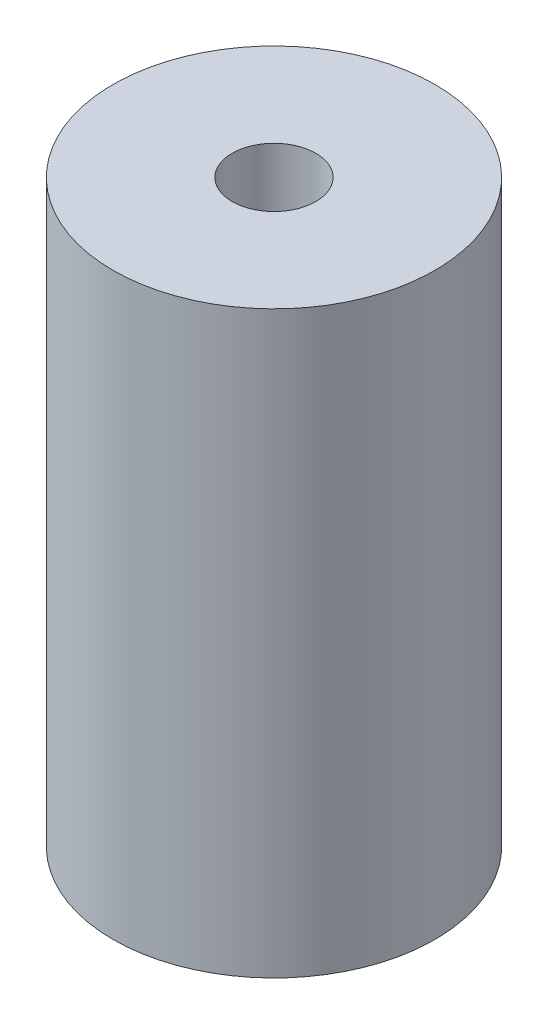
ISO-10303-21;
HEADER;
FILE_DESCRIPTION(('STEP AP214'),'2;1');
FILE_NAME('part.step','',(''),(''),'','','');
FILE_SCHEMA(('AUTOMOTIVE_DESIGN { 1 0 10303 214 1 1 1 1 }'));
ENDSEC;
DATA;
#1=APPLICATION_CONTEXT('core data for automotive mechanical design processes');
#2=APPLICATION_PROTOCOL_DEFINITION('international standard','automotive_design',2000,#1);
#3=PRODUCT_CONTEXT('',#1,'mechanical');
#4=PRODUCT('Part','Part','',(#3));
#5=PRODUCT_RELATED_PRODUCT_CATEGORY('part','',(#4));
#6=PRODUCT_DEFINITION_FORMATION('','',#4);
#7=PRODUCT_DEFINITION_CONTEXT('part definition',#1,'design');
#8=PRODUCT_DEFINITION('design','',#6,#7);
#9=PRODUCT_DEFINITION_SHAPE('','',#8);
#10=(LENGTH_UNIT() NAMED_UNIT(*) SI_UNIT(.MILLI.,.METRE.));
#11=(NAMED_UNIT(*) PLANE_ANGLE_UNIT() SI_UNIT($,.RADIAN.));
#12=(NAMED_UNIT(*) SI_UNIT($,.STERADIAN.) SOLID_ANGLE_UNIT());
#13=UNCERTAINTY_MEASURE_WITH_UNIT(LENGTH_MEASURE(1.E-05),#10,'distance_accuracy_value','');
#14=(GEOMETRIC_REPRESENTATION_CONTEXT(3) GLOBAL_UNCERTAINTY_ASSIGNED_CONTEXT((#13)) GLOBAL_UNIT_ASSIGNED_CONTEXT((#10,
#11,#12)) REPRESENTATION_CONTEXT('',''));
#15=CARTESIAN_POINT('',(0.,0.,0.));
#16=DIRECTION('',(0.,0.,1.));
#17=DIRECTION('',(1.,0.,0.));
#18=AXIS2_PLACEMENT_3D('',#15,#16,#17);
#19=CARTESIAN_POINT('',(0.,800.,0.));
#20=DIRECTION('',(0.,-1.,0.));
#21=DIRECTION('',(0.,0.,-1.));
#22=AXIS2_PLACEMENT_3D('',#19,#20,#21);
#23=CYLINDRICAL_SURFACE('',#22,200.);
#24=CARTESIAN_POINT('',(0.,800.,0.));
#25=DIRECTION('',(0.,-1.,0.));
#26=DIRECTION('',(0.,0.,-1.));
#27=AXIS2_PLACEMENT_3D('',#24,#25,#26);
#28=CIRCLE('',#27,200.);
#29=CARTESIAN_POINT('',(0.,800.,-200.));
#30=VERTEX_POINT('',#29);
#31=EDGE_CURVE('E59',#30,#30,#28,.T.);
#32=ORIENTED_EDGE('',*,*,#31,.F.);
#33=EDGE_LOOP('',(#32));
#34=FACE_BOUND('',#33,.T.);
#35=CARTESIAN_POINT('',(0.,100.,0.));
#36=DIRECTION('',(0.,-1.,0.));
#37=DIRECTION('',(0.,0.,-1.));
#38=AXIS2_PLACEMENT_3D('',#35,#36,#37);
#39=CIRCLE('',#38,200.);
#40=CARTESIAN_POINT('',(0.,100.,-200.));
#41=VERTEX_POINT('',#40);
#42=EDGE_CURVE('E61',#41,#41,#39,.T.);
#43=ORIENTED_EDGE('',*,*,#42,.T.);
#44=EDGE_LOOP('',(#43));
#45=FACE_BOUND('',#44,.T.);
#46=ADVANCED_FACE('F44',(#34,#45),#23,.F.);
#47=CARTESIAN_POINT('',(0.,800.,0.));
#48=DIRECTION('',(0.,-1.,0.));
#49=DIRECTION('',(0.,0.,-1.));
#50=AXIS2_PLACEMENT_3D('',#47,#48,#49);
#51=PLANE('',#50);
#52=CARTESIAN_POINT('',(0.,800.,0.));
#53=DIRECTION('',(0.,-1.,0.));
#54=DIRECTION('',(0.,0.,-1.));
#55=AXIS2_PLACEMENT_3D('',#52,#53,#54);
#56=CIRCLE('',#55,65.);
#57=CARTESIAN_POINT('',(0.,800.,-65.));
#58=VERTEX_POINT('',#57);
#59=EDGE_CURVE('E72',#58,#58,#56,.T.);
#60=ORIENTED_EDGE('',*,*,#59,.F.);
#61=EDGE_LOOP('',(#60));
#62=FACE_BOUND('',#61,.T.);
#63=ORIENTED_EDGE('',*,*,#31,.T.);
#64=EDGE_LOOP('',(#63));
#65=FACE_BOUND('',#64,.T.);
#66=ADVANCED_FACE('F111',(#62,#65),#51,.T.);
#67=CARTESIAN_POINT('',(0.,100.,0.));
#68=DIRECTION('',(0.,-1.,0.));
#69=DIRECTION('',(0.,0.,-1.));
#70=AXIS2_PLACEMENT_3D('',#67,#68,#69);
#71=PLANE('',#70);
#72=CARTESIAN_POINT('',(0.,100.,0.));
#73=DIRECTION('',(0.,-1.,0.));
#74=DIRECTION('',(0.,0.,-1.));
#75=AXIS2_PLACEMENT_3D('',#72,#73,#74);
#76=CIRCLE('',#75,65.);
#77=CARTESIAN_POINT('',(0.,100.,-65.));
#78=VERTEX_POINT('',#77);
#79=EDGE_CURVE('E48',#78,#78,#76,.T.);
#80=ORIENTED_EDGE('',*,*,#79,.T.);
#81=EDGE_LOOP('',(#80));
#82=FACE_BOUND('',#81,.T.);
#83=ORIENTED_EDGE('',*,*,#42,.F.);
#84=EDGE_LOOP('',(#83));
#85=FACE_BOUND('',#84,.T.);
#86=ADVANCED_FACE('F85',(#82,#85),#71,.F.);
#87=CARTESIAN_POINT('',(0.,-456.,0.));
#88=DIRECTION('',(0.,1.,0.));
#89=DIRECTION('',(0.,0.,1.));
#90=AXIS2_PLACEMENT_3D('',#87,#88,#89);
#91=CYLINDRICAL_SURFACE('',#90,65.);
#92=ORIENTED_EDGE('',*,*,#79,.F.);
#93=EDGE_LOOP('',(#92));
#94=FACE_BOUND('',#93,.T.);
#95=CARTESIAN_POINT('',(0.,0.,0.));
#96=DIRECTION('',(0.,1.,0.));
#97=DIRECTION('',(0.,0.,1.));
#98=AXIS2_PLACEMENT_3D('',#95,#96,#97);
#99=CIRCLE('',#98,65.);
#100=CARTESIAN_POINT('',(0.,0.,65.));
#101=VERTEX_POINT('',#100);
#102=EDGE_CURVE('E65',#101,#101,#99,.T.);
#103=ORIENTED_EDGE('',*,*,#102,.F.);
#104=EDGE_LOOP('',(#103));
#105=FACE_BOUND('',#104,.T.);
#106=ADVANCED_FACE('F88',(#94,#105),#91,.F.);
#107=ORIENTED_EDGE('',*,*,#59,.T.);
#108=EDGE_LOOP('',(#107));
#109=FACE_BOUND('',#108,.T.);
#110=CARTESIAN_POINT('',(0.,900.,0.));
#111=DIRECTION('',(0.,1.,0.));
#112=DIRECTION('',(0.,0.,1.));
#113=AXIS2_PLACEMENT_3D('',#110,#111,#112);
#114=CIRCLE('',#113,65.);
#115=CARTESIAN_POINT('',(0.,900.,65.));
#116=VERTEX_POINT('',#115);
#117=EDGE_CURVE('E76',#116,#116,#114,.T.);
#118=ORIENTED_EDGE('',*,*,#117,.T.);
#119=EDGE_LOOP('',(#118));
#120=FACE_BOUND('',#119,.T.);
#121=ADVANCED_FACE('F91',(#109,#120),#91,.F.);
#122=CARTESIAN_POINT('',(0.,900.,0.));
#123=DIRECTION('',(0.,-1.,0.));
#124=DIRECTION('',(0.,0.,-1.));
#125=AXIS2_PLACEMENT_3D('',#122,#123,#124);
#126=CYLINDRICAL_SURFACE('',#125,250.);
#127=CARTESIAN_POINT('',(0.,900.,0.));
#128=DIRECTION('',(0.,1.,0.));
#129=DIRECTION('',(0.,0.,1.));
#130=AXIS2_PLACEMENT_3D('',#127,#128,#129);
#131=CIRCLE('',#130,250.);
#132=CARTESIAN_POINT('',(0.,900.,250.));
#133=VERTEX_POINT('',#132);
#134=EDGE_CURVE('E10',#133,#133,#131,.T.);
#135=ORIENTED_EDGE('',*,*,#134,.F.);
#136=EDGE_LOOP('',(#135));
#137=FACE_BOUND('',#136,.T.);
#138=CARTESIAN_POINT('',(0.,0.,0.));
#139=DIRECTION('',(0.,1.,0.));
#140=DIRECTION('',(0.,0.,1.));
#141=AXIS2_PLACEMENT_3D('',#138,#139,#140);
#142=CIRCLE('',#141,250.);
#143=CARTESIAN_POINT('',(0.,0.,250.));
#144=VERTEX_POINT('',#143);
#145=EDGE_CURVE('E53',#144,#144,#142,.T.);
#146=ORIENTED_EDGE('',*,*,#145,.T.);
#147=EDGE_LOOP('',(#146));
#148=FACE_BOUND('',#147,.T.);
#149=ADVANCED_FACE('F46',(#137,#148),#126,.T.);
#150=CARTESIAN_POINT('',(0.,900.,0.));
#151=DIRECTION('',(0.,1.,0.));
#152=DIRECTION('',(0.,0.,1.));
#153=AXIS2_PLACEMENT_3D('',#150,#151,#152);
#154=PLANE('',#153);
#155=ORIENTED_EDGE('',*,*,#117,.F.);
#156=EDGE_LOOP('',(#155));
#157=FACE_BOUND('',#156,.T.);
#158=ORIENTED_EDGE('',*,*,#134,.T.);
#159=EDGE_LOOP('',(#158));
#160=FACE_BOUND('',#159,.T.);
#161=ADVANCED_FACE('F98',(#157,#160),#154,.T.);
#162=CARTESIAN_POINT('',(0.,0.,0.));
#163=DIRECTION('',(0.,1.,0.));
#164=DIRECTION('',(0.,0.,1.));
#165=AXIS2_PLACEMENT_3D('',#162,#163,#164);
#166=PLANE('',#165);
#167=ORIENTED_EDGE('',*,*,#102,.T.);
#168=EDGE_LOOP('',(#167));
#169=FACE_BOUND('',#168,.T.);
#170=ORIENTED_EDGE('',*,*,#145,.F.);
#171=EDGE_LOOP('',(#170));
#172=FACE_BOUND('',#171,.T.);
#173=ADVANCED_FACE('F95',(#169,#172),#166,.F.);
#174=CLOSED_SHELL('',(#46,#66,#86,#106,#121,#149,#161,#173));
#175=MANIFOLD_SOLID_BREP('B2',#174);
#176=ADVANCED_BREP_SHAPE_REPRESENTATION('',(#18,#175),#14);
#177=SHAPE_DEFINITION_REPRESENTATION(#9,#176);
ENDSEC;
END-ISO-10303-21;
